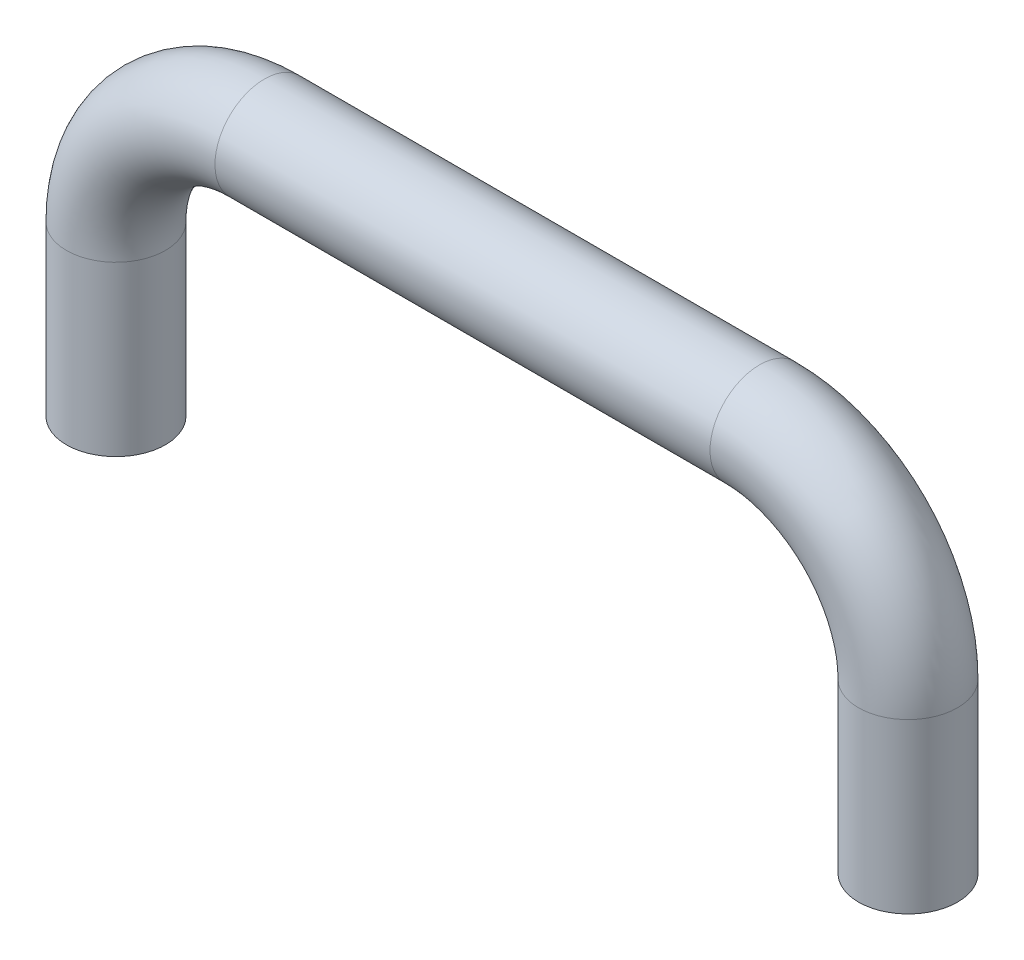
ISO-10303-21;
HEADER;
FILE_DESCRIPTION(('STEP AP214'),'2;1');
FILE_NAME('part.step','',(''),(''),'','','');
FILE_SCHEMA(('AUTOMOTIVE_DESIGN { 1 0 10303 214 1 1 1 1 }'));
ENDSEC;
DATA;
#1=APPLICATION_CONTEXT('core data for automotive mechanical design processes');
#2=APPLICATION_PROTOCOL_DEFINITION('international standard','automotive_design',2000,#1);
#3=PRODUCT_CONTEXT('',#1,'mechanical');
#4=PRODUCT('Part','Part','',(#3));
#5=PRODUCT_RELATED_PRODUCT_CATEGORY('part','',(#4));
#6=PRODUCT_DEFINITION_FORMATION('','',#4);
#7=PRODUCT_DEFINITION_CONTEXT('part definition',#1,'design');
#8=PRODUCT_DEFINITION('design','',#6,#7);
#9=PRODUCT_DEFINITION_SHAPE('','',#8);
#10=(LENGTH_UNIT() NAMED_UNIT(*) SI_UNIT(.MILLI.,.METRE.));
#11=(NAMED_UNIT(*) PLANE_ANGLE_UNIT() SI_UNIT($,.RADIAN.));
#12=(NAMED_UNIT(*) SI_UNIT($,.STERADIAN.) SOLID_ANGLE_UNIT());
#13=UNCERTAINTY_MEASURE_WITH_UNIT(LENGTH_MEASURE(1.E-05),#10,'distance_accuracy_value','');
#14=(GEOMETRIC_REPRESENTATION_CONTEXT(3) GLOBAL_UNCERTAINTY_ASSIGNED_CONTEXT((#13)) GLOBAL_UNIT_ASSIGNED_CONTEXT((#10,
#11,#12)) REPRESENTATION_CONTEXT('',''));
#15=CARTESIAN_POINT('',(0.,0.,0.));
#16=DIRECTION('',(0.,0.,1.));
#17=DIRECTION('',(1.,0.,0.));
#18=AXIS2_PLACEMENT_3D('',#15,#16,#17);
#19=CARTESIAN_POINT('',(40.,17.,0.));
#20=DIRECTION('',(0.,-1.,0.));
#21=DIRECTION('',(0.,0.,-1.));
#22=AXIS2_PLACEMENT_3D('',#19,#20,#21);
#23=CYLINDRICAL_SURFACE('',#22,5.);
#24=CARTESIAN_POINT('',(40.,17.,0.));
#25=DIRECTION('',(0.,-1.,0.));
#26=DIRECTION('',(0.,0.,1.));
#27=AXIS2_PLACEMENT_3D('',#24,#25,#26);
#28=CIRCLE('',#27,5.);
#29=CARTESIAN_POINT('',(45.,17.,0.));
#30=VERTEX_POINT('',#29);
#31=EDGE_CURVE('E50',#30,#30,#28,.T.);
#32=ORIENTED_EDGE('',*,*,#31,.T.);
#33=EDGE_LOOP('',(#32));
#34=FACE_BOUND('',#33,.T.);
#35=CARTESIAN_POINT('',(40.,0.,0.));
#36=DIRECTION('',(0.,-1.,0.));
#37=DIRECTION('',(0.,0.,1.));
#38=AXIS2_PLACEMENT_3D('',#35,#36,#37);
#39=CIRCLE('',#38,5.);
#40=CARTESIAN_POINT('',(40.,0.,5.));
#41=VERTEX_POINT('',#40);
#42=EDGE_CURVE('E11',#41,#41,#39,.T.);
#43=ORIENTED_EDGE('',*,*,#42,.F.);
#44=EDGE_LOOP('',(#43));
#45=FACE_BOUND('',#44,.T.);
#46=ADVANCED_FACE('F43',(#34,#45),#23,.T.);
#47=CARTESIAN_POINT('',(25.,17.,0.));
#48=DIRECTION('',(0.,0.,-1.));
#49=DIRECTION('',(-1.,0.,0.));
#50=AXIS2_PLACEMENT_3D('',#47,#48,#49);
#51=TOROIDAL_SURFACE('',#50,15.,5.);
#52=CARTESIAN_POINT('',(25.,32.,0.));
#53=DIRECTION('',(1.,0.,0.));
#54=DIRECTION('',(0.,0.,1.));
#55=AXIS2_PLACEMENT_3D('',#52,#53,#54);
#56=CIRCLE('',#55,5.);
#57=CARTESIAN_POINT('',(25.,37.,0.));
#58=VERTEX_POINT('',#57);
#59=EDGE_CURVE('E86',#58,#58,#56,.T.);
#60=CARTESIAN_POINT('',(25.,17.,0.));
#61=DIRECTION('',(0.,0.,-1.));
#62=DIRECTION('',(-1.,0.,0.));
#63=AXIS2_PLACEMENT_3D('',#60,#61,#62);
#64=CIRCLE('',#63,20.);
#65=EDGE_CURVE('',#58,#30,#64,.T.);
#66=ORIENTED_EDGE('',*,*,#59,.T.);
#67=ORIENTED_EDGE('',*,*,#31,.F.);
#68=ORIENTED_EDGE('',*,*,#65,.T.);
#69=ORIENTED_EDGE('',*,*,#65,.F.);
#70=EDGE_LOOP('',(#66,#68,#67,#69));
#71=FACE_BOUND('',#70,.T.);
#72=ADVANCED_FACE('F93',(#71),#51,.T.);
#73=CARTESIAN_POINT('',(-25.,32.,0.));
#74=DIRECTION('',(1.,0.,0.));
#75=DIRECTION('',(0.,1.,0.));
#76=AXIS2_PLACEMENT_3D('',#73,#74,#75);
#77=CYLINDRICAL_SURFACE('',#76,5.);
#78=CARTESIAN_POINT('',(-25.,32.,0.));
#79=DIRECTION('',(1.,0.,0.));
#80=DIRECTION('',(0.,0.,1.));
#81=AXIS2_PLACEMENT_3D('',#78,#79,#80);
#82=CIRCLE('',#81,5.);
#83=CARTESIAN_POINT('',(-25.,37.,0.));
#84=VERTEX_POINT('',#83);
#85=EDGE_CURVE('E81',#84,#84,#82,.T.);
#86=ORIENTED_EDGE('',*,*,#85,.T.);
#87=EDGE_LOOP('',(#86));
#88=FACE_BOUND('',#87,.T.);
#89=ORIENTED_EDGE('',*,*,#59,.F.);
#90=EDGE_LOOP('',(#89));
#91=FACE_BOUND('',#90,.T.);
#92=ADVANCED_FACE('F95',(#88,#91),#77,.T.);
#93=CARTESIAN_POINT('',(-25.,17.,0.));
#94=DIRECTION('',(0.,0.,-1.));
#95=DIRECTION('',(-1.,0.,0.));
#96=AXIS2_PLACEMENT_3D('',#93,#94,#95);
#97=TOROIDAL_SURFACE('',#96,15.,5.);
#98=CARTESIAN_POINT('',(-40.,17.,0.));
#99=DIRECTION('',(0.,1.,0.));
#100=DIRECTION('',(0.,0.,1.));
#101=AXIS2_PLACEMENT_3D('',#98,#99,#100);
#102=CIRCLE('',#101,5.);
#103=CARTESIAN_POINT('',(-45.,17.,0.));
#104=VERTEX_POINT('',#103);
#105=EDGE_CURVE('E78',#104,#104,#102,.T.);
#106=CARTESIAN_POINT('',(-25.,17.,0.));
#107=DIRECTION('',(0.,0.,-1.));
#108=DIRECTION('',(-1.,0.,0.));
#109=AXIS2_PLACEMENT_3D('',#106,#107,#108);
#110=CIRCLE('',#109,20.);
#111=EDGE_CURVE('',#104,#84,#110,.T.);
#112=ORIENTED_EDGE('',*,*,#105,.T.);
#113=ORIENTED_EDGE('',*,*,#85,.F.);
#114=ORIENTED_EDGE('',*,*,#111,.T.);
#115=ORIENTED_EDGE('',*,*,#111,.F.);
#116=EDGE_LOOP('',(#112,#114,#113,#115));
#117=FACE_BOUND('',#116,.T.);
#118=ADVANCED_FACE('F101',(#117),#97,.T.);
#119=CARTESIAN_POINT('',(-40.,17.,0.));
#120=DIRECTION('',(0.,-1.,0.));
#121=DIRECTION('',(1.,0.,0.));
#122=AXIS2_PLACEMENT_3D('',#119,#120,#121);
#123=CYLINDRICAL_SURFACE('',#122,5.);
#124=ORIENTED_EDGE('',*,*,#105,.F.);
#125=EDGE_LOOP('',(#124));
#126=FACE_BOUND('',#125,.T.);
#127=CARTESIAN_POINT('',(-40.,0.,0.));
#128=DIRECTION('',(0.,1.,0.));
#129=DIRECTION('',(0.,0.,1.));
#130=AXIS2_PLACEMENT_3D('',#127,#128,#129);
#131=CIRCLE('',#130,5.);
#132=CARTESIAN_POINT('',(-40.,0.,5.));
#133=VERTEX_POINT('',#132);
#134=EDGE_CURVE('E77',#133,#133,#131,.T.);
#135=ORIENTED_EDGE('',*,*,#134,.T.);
#136=EDGE_LOOP('',(#135));
#137=FACE_BOUND('',#136,.T.);
#138=ADVANCED_FACE('F107',(#126,#137),#123,.T.);
#139=CARTESIAN_POINT('',(40.,0.,0.));
#140=DIRECTION('',(0.,-1.,0.));
#141=DIRECTION('',(0.,0.,1.));
#142=AXIS2_PLACEMENT_3D('',#139,#140,#141);
#143=PLANE('',#142);
#144=CARTESIAN_POINT('',(40.,0.,0.));
#145=DIRECTION('',(0.,-1.,0.));
#146=DIRECTION('',(0.,0.,-1.));
#147=AXIS2_PLACEMENT_3D('',#144,#145,#146);
#148=CIRCLE('',#147,2.067);
#149=CARTESIAN_POINT('',(40.,0.,-2.067));
#150=VERTEX_POINT('',#149);
#151=EDGE_CURVE('E66',#150,#150,#148,.T.);
#152=ORIENTED_EDGE('',*,*,#151,.F.);
#153=EDGE_LOOP('',(#152));
#154=FACE_BOUND('',#153,.T.);
#155=ORIENTED_EDGE('',*,*,#42,.T.);
#156=EDGE_LOOP('',(#155));
#157=FACE_BOUND('',#156,.T.);
#158=ADVANCED_FACE('F111',(#154,#157),#143,.T.);
#159=CARTESIAN_POINT('',(-40.,0.,0.));
#160=DIRECTION('',(0.,1.,0.));
#161=DIRECTION('',(0.,0.,1.));
#162=AXIS2_PLACEMENT_3D('',#159,#160,#161);
#163=PLANE('',#162);
#164=CARTESIAN_POINT('',(-40.,0.,0.));
#165=DIRECTION('',(0.,-1.,0.));
#166=DIRECTION('',(0.,0.,-1.));
#167=AXIS2_PLACEMENT_3D('',#164,#165,#166);
#168=CIRCLE('',#167,2.067);
#169=CARTESIAN_POINT('',(-40.,0.,-2.067));
#170=VERTEX_POINT('',#169);
#171=EDGE_CURVE('E67',#170,#170,#168,.T.);
#172=ORIENTED_EDGE('',*,*,#171,.F.);
#173=EDGE_LOOP('',(#172));
#174=FACE_BOUND('',#173,.T.);
#175=ORIENTED_EDGE('',*,*,#134,.F.);
#176=EDGE_LOOP('',(#175));
#177=FACE_BOUND('',#176,.T.);
#178=ADVANCED_FACE('F113',(#174,#177),#163,.F.);
#179=CARTESIAN_POINT('',(40.,10.,0.));
#180=DIRECTION('',(0.,-1.,0.));
#181=DIRECTION('',(0.,0.,-1.));
#182=AXIS2_PLACEMENT_3D('',#179,#180,#181);
#183=CONICAL_SURFACE('',#182,2.067,1.02974425867665);
#184=CARTESIAN_POINT('',(40.,11.24197889953,0.));
#185=VERTEX_POINT('',#184);
#186=VERTEX_LOOP('',#185);
#187=FACE_BOUND('',#186,.T.);
#188=CARTESIAN_POINT('',(40.,10.,0.));
#189=DIRECTION('',(0.,-1.,0.));
#190=DIRECTION('',(0.,0.,-1.));
#191=AXIS2_PLACEMENT_3D('',#188,#189,#190);
#192=CIRCLE('',#191,2.067);
#193=CARTESIAN_POINT('',(40.,10.,-2.067));
#194=VERTEX_POINT('',#193);
#195=EDGE_CURVE('E70',#194,#194,#192,.T.);
#196=ORIENTED_EDGE('',*,*,#195,.T.);
#197=EDGE_LOOP('',(#196));
#198=FACE_BOUND('',#197,.T.);
#199=ADVANCED_FACE('F116',(#187,#198),#183,.F.);
#200=CARTESIAN_POINT('',(40.,0.,0.));
#201=DIRECTION('',(0.,-1.,0.));
#202=DIRECTION('',(0.,0.,-1.));
#203=AXIS2_PLACEMENT_3D('',#200,#201,#202);
#204=CYLINDRICAL_SURFACE('',#203,2.067);
#205=ORIENTED_EDGE('',*,*,#195,.F.);
#206=EDGE_LOOP('',(#205));
#207=FACE_BOUND('',#206,.T.);
#208=ORIENTED_EDGE('',*,*,#151,.T.);
#209=EDGE_LOOP('',(#208));
#210=FACE_BOUND('',#209,.T.);
#211=ADVANCED_FACE('F60',(#207,#210),#204,.F.);
#212=CARTESIAN_POINT('',(-40.,10.,0.));
#213=DIRECTION('',(0.,-1.,0.));
#214=DIRECTION('',(0.,0.,-1.));
#215=AXIS2_PLACEMENT_3D('',#212,#213,#214);
#216=CONICAL_SURFACE('',#215,2.067,1.02974425867665);
#217=CARTESIAN_POINT('',(-40.,11.24197889953,0.));
#218=VERTEX_POINT('',#217);
#219=VERTEX_LOOP('',#218);
#220=FACE_BOUND('',#219,.T.);
#221=CARTESIAN_POINT('',(-40.,10.,0.));
#222=DIRECTION('',(0.,-1.,0.));
#223=DIRECTION('',(0.,0.,-1.));
#224=AXIS2_PLACEMENT_3D('',#221,#222,#223);
#225=CIRCLE('',#224,2.067);
#226=CARTESIAN_POINT('',(-40.,10.,-2.067));
#227=VERTEX_POINT('',#226);
#228=EDGE_CURVE('E64',#227,#227,#225,.T.);
#229=ORIENTED_EDGE('',*,*,#228,.T.);
#230=EDGE_LOOP('',(#229));
#231=FACE_BOUND('',#230,.T.);
#232=ADVANCED_FACE('F56',(#220,#231),#216,.F.);
#233=CARTESIAN_POINT('',(-40.,0.,0.));
#234=DIRECTION('',(0.,-1.,0.));
#235=DIRECTION('',(0.,0.,-1.));
#236=AXIS2_PLACEMENT_3D('',#233,#234,#235);
#237=CYLINDRICAL_SURFACE('',#236,2.067);
#238=ORIENTED_EDGE('',*,*,#228,.F.);
#239=EDGE_LOOP('',(#238));
#240=FACE_BOUND('',#239,.T.);
#241=ORIENTED_EDGE('',*,*,#171,.T.);
#242=EDGE_LOOP('',(#241));
#243=FACE_BOUND('',#242,.T.);
#244=ADVANCED_FACE('F59',(#240,#243),#237,.F.);
#245=CLOSED_SHELL('',(#46,#72,#92,#118,#138,#158,#178,#199,#211,#232,#244));
#246=MANIFOLD_SOLID_BREP('B2',#245);
#247=ADVANCED_BREP_SHAPE_REPRESENTATION('',(#18,#246),#14);
#248=SHAPE_DEFINITION_REPRESENTATION(#9,#247);
ENDSEC;
END-ISO-10303-21;
